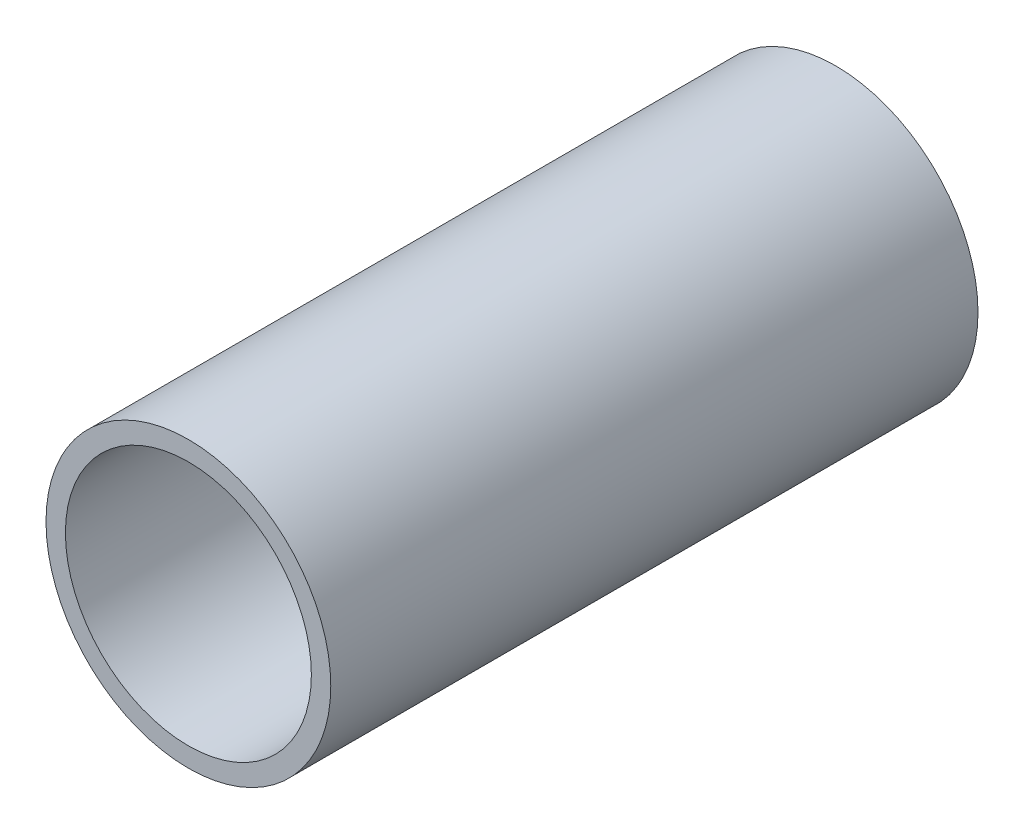
ISO-10303-21;
HEADER;
FILE_DESCRIPTION(('STEP AP214'),'2;1');
FILE_NAME('part.step','',(''),(''),'','','');
FILE_SCHEMA(('AUTOMOTIVE_DESIGN { 1 0 10303 214 1 1 1 1 }'));
ENDSEC;
DATA;
#1=APPLICATION_CONTEXT('core data for automotive mechanical design processes');
#2=APPLICATION_PROTOCOL_DEFINITION('international standard','automotive_design',2000,#1);
#3=PRODUCT_CONTEXT('',#1,'mechanical');
#4=PRODUCT('Part','Part','',(#3));
#5=PRODUCT_RELATED_PRODUCT_CATEGORY('part','',(#4));
#6=PRODUCT_DEFINITION_FORMATION('','',#4);
#7=PRODUCT_DEFINITION_CONTEXT('part definition',#1,'design');
#8=PRODUCT_DEFINITION('design','',#6,#7);
#9=PRODUCT_DEFINITION_SHAPE('','',#8);
#10=(LENGTH_UNIT() NAMED_UNIT(*) SI_UNIT(.MILLI.,.METRE.));
#11=(NAMED_UNIT(*) PLANE_ANGLE_UNIT() SI_UNIT($,.RADIAN.));
#12=(NAMED_UNIT(*) SI_UNIT($,.STERADIAN.) SOLID_ANGLE_UNIT());
#13=UNCERTAINTY_MEASURE_WITH_UNIT(LENGTH_MEASURE(1.E-05),#10,'distance_accuracy_value','');
#14=(GEOMETRIC_REPRESENTATION_CONTEXT(3) GLOBAL_UNCERTAINTY_ASSIGNED_CONTEXT((#13)) GLOBAL_UNIT_ASSIGNED_CONTEXT((#10,
#11,#12)) REPRESENTATION_CONTEXT('',''));
#15=CARTESIAN_POINT('',(0.,0.,0.));
#16=DIRECTION('',(0.,0.,1.));
#17=DIRECTION('',(1.,0.,0.));
#18=AXIS2_PLACEMENT_3D('',#15,#16,#17);
#19=CARTESIAN_POINT('',(0.,0.,100.));
#20=DIRECTION('',(0.,0.,1.));
#21=DIRECTION('',(1.,0.,0.));
#22=AXIS2_PLACEMENT_3D('',#19,#20,#21);
#23=PLANE('',#22);
#24=CARTESIAN_POINT('',(0.,0.,100.));
#25=DIRECTION('',(0.,0.,1.));
#26=DIRECTION('',(1.,0.,0.));
#27=AXIS2_PLACEMENT_3D('',#24,#25,#26);
#28=CIRCLE('',#27,22.);
#29=CARTESIAN_POINT('',(22.,0.,100.));
#30=VERTEX_POINT('',#29);
#31=EDGE_CURVE('E10',#30,#30,#28,.T.);
#32=ORIENTED_EDGE('',*,*,#31,.T.);
#33=EDGE_LOOP('',(#32));
#34=FACE_BOUND('',#33,.T.);
#35=CARTESIAN_POINT('',(0.,0.,100.));
#36=DIRECTION('',(0.,0.,1.));
#37=DIRECTION('',(1.,0.,0.));
#38=AXIS2_PLACEMENT_3D('',#35,#36,#37);
#39=CIRCLE('',#38,19.);
#40=CARTESIAN_POINT('',(19.,0.,100.));
#41=VERTEX_POINT('',#40);
#42=EDGE_CURVE('E44',#41,#41,#39,.T.);
#43=ORIENTED_EDGE('',*,*,#42,.F.);
#44=EDGE_LOOP('',(#43));
#45=FACE_BOUND('',#44,.T.);
#46=ADVANCED_FACE('F33',(#34,#45),#23,.T.);
#47=CARTESIAN_POINT('',(0.,0.,0.));
#48=DIRECTION('',(0.,0.,1.));
#49=DIRECTION('',(1.,0.,0.));
#50=AXIS2_PLACEMENT_3D('',#47,#48,#49);
#51=PLANE('',#50);
#52=CARTESIAN_POINT('',(0.,0.,0.));
#53=DIRECTION('',(0.,0.,1.));
#54=DIRECTION('',(1.,0.,0.));
#55=AXIS2_PLACEMENT_3D('',#52,#53,#54);
#56=CIRCLE('',#55,22.);
#57=CARTESIAN_POINT('',(22.,0.,0.));
#58=VERTEX_POINT('',#57);
#59=EDGE_CURVE('E37',#58,#58,#56,.T.);
#60=ORIENTED_EDGE('',*,*,#59,.F.);
#61=EDGE_LOOP('',(#60));
#62=FACE_BOUND('',#61,.T.);
#63=CARTESIAN_POINT('',(0.,0.,0.));
#64=DIRECTION('',(0.,0.,1.));
#65=DIRECTION('',(1.,0.,0.));
#66=AXIS2_PLACEMENT_3D('',#63,#64,#65);
#67=CIRCLE('',#66,19.);
#68=CARTESIAN_POINT('',(19.,0.,0.));
#69=VERTEX_POINT('',#68);
#70=EDGE_CURVE('E46',#69,#69,#67,.T.);
#71=ORIENTED_EDGE('',*,*,#70,.T.);
#72=EDGE_LOOP('',(#71));
#73=FACE_BOUND('',#72,.T.);
#74=ADVANCED_FACE('F56',(#62,#73),#51,.F.);
#75=CARTESIAN_POINT('',(0.,0.,100.));
#76=DIRECTION('',(0.,0.,-1.));
#77=DIRECTION('',(-1.,0.,0.));
#78=AXIS2_PLACEMENT_3D('',#75,#76,#77);
#79=CYLINDRICAL_SURFACE('',#78,22.);
#80=ORIENTED_EDGE('',*,*,#31,.F.);
#81=EDGE_LOOP('',(#80));
#82=FACE_BOUND('',#81,.T.);
#83=ORIENTED_EDGE('',*,*,#59,.T.);
#84=EDGE_LOOP('',(#83));
#85=FACE_BOUND('',#84,.T.);
#86=ADVANCED_FACE('F35',(#82,#85),#79,.T.);
#87=CARTESIAN_POINT('',(0.,0.,100.));
#88=DIRECTION('',(0.,0.,-1.));
#89=DIRECTION('',(-1.,0.,0.));
#90=AXIS2_PLACEMENT_3D('',#87,#88,#89);
#91=CYLINDRICAL_SURFACE('',#90,19.);
#92=ORIENTED_EDGE('',*,*,#42,.T.);
#93=EDGE_LOOP('',(#92));
#94=FACE_BOUND('',#93,.T.);
#95=ORIENTED_EDGE('',*,*,#70,.F.);
#96=EDGE_LOOP('',(#95));
#97=FACE_BOUND('',#96,.T.);
#98=ADVANCED_FACE('F52',(#94,#97),#91,.F.);
#99=CLOSED_SHELL('',(#46,#74,#86,#98));
#100=MANIFOLD_SOLID_BREP('B2',#99);
#101=ADVANCED_BREP_SHAPE_REPRESENTATION('',(#18,#100),#14);
#102=SHAPE_DEFINITION_REPRESENTATION(#9,#101);
ENDSEC;
END-ISO-10303-21;
